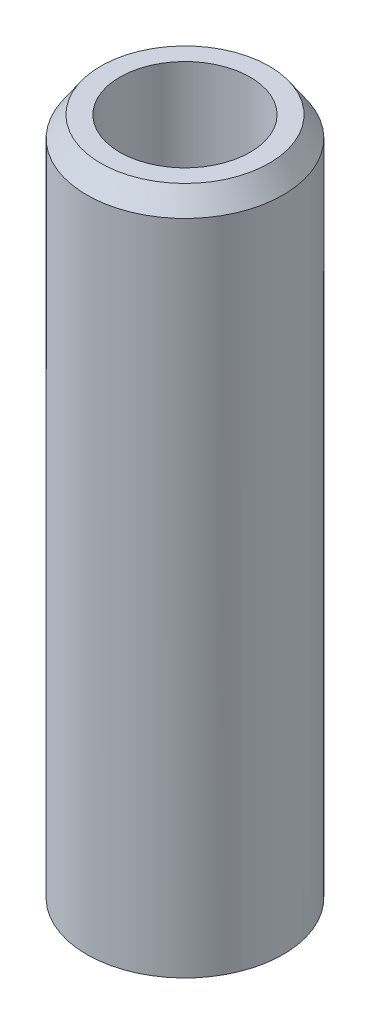
ISO-10303-21;
HEADER;
FILE_DESCRIPTION(('STEP AP214'),'2;1');
FILE_NAME('part.step','',(''),(''),'','','');
FILE_SCHEMA(('AUTOMOTIVE_DESIGN { 1 0 10303 214 1 1 1 1 }'));
ENDSEC;
DATA;
#1=APPLICATION_CONTEXT('core data for automotive mechanical design processes');
#2=APPLICATION_PROTOCOL_DEFINITION('international standard','automotive_design',2000,#1);
#3=PRODUCT_CONTEXT('',#1,'mechanical');
#4=PRODUCT('Part','Part','',(#3));
#5=PRODUCT_RELATED_PRODUCT_CATEGORY('part','',(#4));
#6=PRODUCT_DEFINITION_FORMATION('','',#4);
#7=PRODUCT_DEFINITION_CONTEXT('part definition',#1,'design');
#8=PRODUCT_DEFINITION('design','',#6,#7);
#9=PRODUCT_DEFINITION_SHAPE('','',#8);
#10=(LENGTH_UNIT() NAMED_UNIT(*) SI_UNIT(.MILLI.,.METRE.));
#11=(NAMED_UNIT(*) PLANE_ANGLE_UNIT() SI_UNIT($,.RADIAN.));
#12=(NAMED_UNIT(*) SI_UNIT($,.STERADIAN.) SOLID_ANGLE_UNIT());
#13=UNCERTAINTY_MEASURE_WITH_UNIT(LENGTH_MEASURE(1.E-05),#10,'distance_accuracy_value','');
#14=(GEOMETRIC_REPRESENTATION_CONTEXT(3) GLOBAL_UNCERTAINTY_ASSIGNED_CONTEXT((#13)) GLOBAL_UNIT_ASSIGNED_CONTEXT((#10,
#11,#12)) REPRESENTATION_CONTEXT('',''));
#15=CARTESIAN_POINT('',(0.,0.,0.));
#16=DIRECTION('',(0.,0.,1.));
#17=DIRECTION('',(1.,0.,0.));
#18=AXIS2_PLACEMENT_3D('',#15,#16,#17);
#19=CARTESIAN_POINT('',(0.,158.595899496815,0.));
#20=DIRECTION('',(0.,-1.,0.));
#21=DIRECTION('',(0.,0.,-1.));
#22=AXIS2_PLACEMENT_3D('',#19,#20,#21);
#23=CYLINDRICAL_SURFACE('',#22,22.5);
#24=CARTESIAN_POINT('',(0.,153.913828530528,0.));
#25=DIRECTION('',(0.,1.,0.));
#26=DIRECTION('',(0.,0.,1.));
#27=AXIS2_PLACEMENT_3D('',#24,#25,#26);
#28=CIRCLE('',#27,22.5);
#29=CARTESIAN_POINT('',(0.,153.913828530528,-22.5));
#30=VERTEX_POINT('',#29);
#31=EDGE_CURVE('E50',#30,#30,#28,.F.);
#32=ORIENTED_EDGE('',*,*,#31,.T.);
#33=EDGE_LOOP('',(#32));
#34=FACE_BOUND('',#33,.T.);
#35=CARTESIAN_POINT('',(0.,3.20565268522194,0.));
#36=DIRECTION('',(0.,1.,0.));
#37=DIRECTION('',(0.,0.,1.));
#38=AXIS2_PLACEMENT_3D('',#35,#36,#37);
#39=CIRCLE('',#38,22.5);
#40=CARTESIAN_POINT('',(0.,3.20565268522194,22.5));
#41=VERTEX_POINT('',#40);
#42=EDGE_CURVE('E51',#41,#41,#39,.T.);
#43=ORIENTED_EDGE('',*,*,#42,.T.);
#44=EDGE_LOOP('',(#43));
#45=FACE_BOUND('',#44,.T.);
#46=ADVANCED_FACE('F39',(#34,#45),#23,.T.);
#47=CARTESIAN_POINT('',(0.,158.595899496815,0.));
#48=DIRECTION('',(0.,1.,0.));
#49=DIRECTION('',(0.,0.,1.));
#50=AXIS2_PLACEMENT_3D('',#47,#48,#49);
#51=PLANE('',#50);
#52=CARTESIAN_POINT('',(0.,158.595899496815,0.));
#53=DIRECTION('',(0.,1.,0.));
#54=DIRECTION('',(0.,0.,1.));
#55=AXIS2_PLACEMENT_3D('',#52,#53,#54);
#56=CIRCLE('',#55,19.294347314778);
#57=CARTESIAN_POINT('',(0.,158.595899496815,-19.2943473147781));
#58=VERTEX_POINT('',#57);
#59=EDGE_CURVE('E54',#58,#58,#56,.T.);
#60=ORIENTED_EDGE('',*,*,#59,.T.);
#61=EDGE_LOOP('',(#60));
#62=FACE_BOUND('',#61,.T.);
#63=CARTESIAN_POINT('',(0.,158.595899496815,0.));
#64=DIRECTION('',(0.,1.,0.));
#65=DIRECTION('',(0.,0.,1.));
#66=AXIS2_PLACEMENT_3D('',#63,#64,#65);
#67=CIRCLE('',#66,14.9268336571655);
#68=CARTESIAN_POINT('',(0.,158.595899496815,14.9268336571655));
#69=VERTEX_POINT('',#68);
#70=EDGE_CURVE('E58',#69,#69,#67,.T.);
#71=ORIENTED_EDGE('',*,*,#70,.F.);
#72=EDGE_LOOP('',(#71));
#73=FACE_BOUND('',#72,.T.);
#74=ADVANCED_FACE('F69',(#62,#73),#51,.T.);
#75=CARTESIAN_POINT('',(0.,0.,0.));
#76=DIRECTION('',(0.,1.,0.));
#77=DIRECTION('',(0.,0.,1.));
#78=AXIS2_PLACEMENT_3D('',#75,#76,#77);
#79=PLANE('',#78);
#80=CARTESIAN_POINT('',(0.,0.,0.));
#81=DIRECTION('',(0.,1.,0.));
#82=DIRECTION('',(0.,0.,1.));
#83=AXIS2_PLACEMENT_3D('',#80,#81,#82);
#84=CIRCLE('',#83,17.8179290337135);
#85=CARTESIAN_POINT('',(0.,0.,17.8179290337135));
#86=VERTEX_POINT('',#85);
#87=EDGE_CURVE('E10',#86,#86,#84,.F.);
#88=ORIENTED_EDGE('',*,*,#87,.T.);
#89=EDGE_LOOP('',(#88));
#90=FACE_BOUND('',#89,.T.);
#91=CARTESIAN_POINT('',(0.,0.,0.));
#92=DIRECTION('',(0.,1.,0.));
#93=DIRECTION('',(0.,0.,1.));
#94=AXIS2_PLACEMENT_3D('',#91,#92,#93);
#95=CIRCLE('',#94,14.9268336571655);
#96=CARTESIAN_POINT('',(0.,0.,14.9268336571655));
#97=VERTEX_POINT('',#96);
#98=EDGE_CURVE('E63',#97,#97,#95,.T.);
#99=ORIENTED_EDGE('',*,*,#98,.T.);
#100=EDGE_LOOP('',(#99));
#101=FACE_BOUND('',#100,.T.);
#102=ADVANCED_FACE('F75',(#90,#101),#79,.F.);
#103=CARTESIAN_POINT('',(0.,158.595899496815,0.));
#104=DIRECTION('',(0.,-1.,0.));
#105=DIRECTION('',(0.,0.,-1.));
#106=AXIS2_PLACEMENT_3D('',#103,#104,#105);
#107=CYLINDRICAL_SURFACE('',#106,14.9268336571655);
#108=ORIENTED_EDGE('',*,*,#70,.T.);
#109=EDGE_LOOP('',(#108));
#110=FACE_BOUND('',#109,.T.);
#111=ORIENTED_EDGE('',*,*,#98,.F.);
#112=EDGE_LOOP('',(#111));
#113=FACE_BOUND('',#112,.T.);
#114=ADVANCED_FACE('F70',(#110,#113),#107,.F.);
#115=CARTESIAN_POINT('',(0.,158.595899496815,0.));
#116=DIRECTION('',(0.,-1.,0.));
#117=DIRECTION('',(0.,0.,-1.));
#118=AXIS2_PLACEMENT_3D('',#115,#116,#117);
#119=CONICAL_SURFACE('',#118,19.294347314778,0.600360077738182);
#120=CARTESIAN_POINT('',(0.,153.913828530528,-22.5));
#121=CARTESIAN_POINT('',(0.,153.962600103094,-22.4666077845289));
#122=CARTESIAN_POINT('',(0.,154.011371675659,-22.4332155690579));
#123=CARTESIAN_POINT('',(0.,154.10891482079,-22.3664311381158));
#124=CARTESIAN_POINT('',(0.,154.157686393356,-22.3330389226447));
#125=CARTESIAN_POINT('',(0.,154.255229538487,-22.2662544917026));
#126=CARTESIAN_POINT('',(0.,154.304001111052,-22.2328622762315));
#127=CARTESIAN_POINT('',(0.,154.401544256183,-22.1660778452894));
#128=CARTESIAN_POINT('',(0.,154.450315828749,-22.1326856298183));
#129=CARTESIAN_POINT('',(0.,154.54785897388,-22.0659011988762));
#130=CARTESIAN_POINT('',(0.,154.596630546445,-22.0325089834051));
#131=CARTESIAN_POINT('',(0.,154.694173691576,-21.965724552463));
#132=CARTESIAN_POINT('',(0.,154.742945264142,-21.932332336992));
#133=CARTESIAN_POINT('',(0.,154.840488409272,-21.8655479060498));
#134=CARTESIAN_POINT('',(0.,154.889259981838,-21.8321556905788));
#135=CARTESIAN_POINT('',(0.,154.986803126969,-21.7653712596366));
#136=CARTESIAN_POINT('',(0.,155.035574699534,-21.7319790441656));
#137=CARTESIAN_POINT('',(0.,155.133117844665,-21.6651946132235));
#138=CARTESIAN_POINT('',(0.,155.181889417231,-21.6318023977524));
#139=CARTESIAN_POINT('',(0.,155.279432562362,-21.5650179668103));
#140=CARTESIAN_POINT('',(0.,155.328204134927,-21.5316257513392));
#141=CARTESIAN_POINT('',(0.,155.425747280058,-21.4648413203971));
#142=CARTESIAN_POINT('',(0.,155.474518852624,-21.431449104926));
#143=CARTESIAN_POINT('',(0.,155.572061997755,-21.3646646739839));
#144=CARTESIAN_POINT('',(0.,155.62083357032,-21.3312724585128));
#145=CARTESIAN_POINT('',(0.,155.718376715451,-21.2644880275707));
#146=CARTESIAN_POINT('',(0.,155.767148288017,-21.2310958120997));
#147=CARTESIAN_POINT('',(0.,155.864691433148,-21.1643113811575));
#148=CARTESIAN_POINT('',(0.,155.913463005713,-21.1309191656865));
#149=CARTESIAN_POINT('',(0.,156.011006150844,-21.0641347347443));
#150=CARTESIAN_POINT('',(0.,156.05977772341,-21.0307425192733));
#151=CARTESIAN_POINT('',(0.,156.157320868541,-20.9639580883312));
#152=CARTESIAN_POINT('',(0.,156.206092441106,-20.9305658728601));
#153=CARTESIAN_POINT('',(0.,156.303635586237,-20.863781441918));
#154=CARTESIAN_POINT('',(0.,156.352407158803,-20.8303892264469));
#155=CARTESIAN_POINT('',(0.,156.449950303934,-20.7636047955048));
#156=CARTESIAN_POINT('',(0.,156.498721876499,-20.7302125800337));
#157=CARTESIAN_POINT('',(0.,156.59626502163,-20.6634281490916));
#158=CARTESIAN_POINT('',(0.,156.645036594195,-20.6300359336205));
#159=CARTESIAN_POINT('',(0.,156.742579739326,-20.5632515026784));
#160=CARTESIAN_POINT('',(0.,156.791351311892,-20.5298592872073));
#161=CARTESIAN_POINT('',(0.,156.888894457023,-20.4630748562652));
#162=CARTESIAN_POINT('',(0.,156.937666029588,-20.4296826407942));
#163=CARTESIAN_POINT('',(0.,157.035209174719,-20.362898209852));
#164=CARTESIAN_POINT('',(0.,157.083980747285,-20.329505994381));
#165=CARTESIAN_POINT('',(0.,157.181523892416,-20.2627215634388));
#166=CARTESIAN_POINT('',(0.,157.230295464981,-20.2293293479678));
#167=CARTESIAN_POINT('',(0.,157.327838610112,-20.1625449170257));
#168=CARTESIAN_POINT('',(0.,157.376610182678,-20.1291527015546));
#169=CARTESIAN_POINT('',(0.,157.474153327809,-20.0623682706125));
#170=CARTESIAN_POINT('',(0.,157.522924900374,-20.0289760551414));
#171=CARTESIAN_POINT('',(0.,157.620468045505,-19.9621916241993));
#172=CARTESIAN_POINT('',(0.,157.669239618071,-19.9287994087282));
#173=CARTESIAN_POINT('',(0.,157.766782763202,-19.8620149777861));
#174=CARTESIAN_POINT('',(0.,157.815554335767,-19.828622762315));
#175=CARTESIAN_POINT('',(0.,157.913097480898,-19.7618383313729));
#176=CARTESIAN_POINT('',(0.,157.961869053464,-19.7284461159019));
#177=CARTESIAN_POINT('',(0.,158.059412198595,-19.6616616849597));
#178=CARTESIAN_POINT('',(0.,158.10818377116,-19.6282694694887));
#179=CARTESIAN_POINT('',(0.,158.205726916291,-19.5614850385465));
#180=CARTESIAN_POINT('',(0.,158.254498488856,-19.5280928230755));
#181=CARTESIAN_POINT('',(0.,158.352041633987,-19.4613083921334));
#182=CARTESIAN_POINT('',(0.,158.400813206553,-19.4279161766623));
#183=CARTESIAN_POINT('',(0.,158.498356351684,-19.3611317457202));
#184=CARTESIAN_POINT('',(0.,158.547127924249,-19.3277395302491));
#185=CARTESIAN_POINT('',(0.,158.595899496815,-19.2943473147781));
#186=B_SPLINE_CURVE_WITH_KNOTS('',3,(#120,#121,#122,#123,#124,#125,#126,#127,#128,#129,#130,
#131,#132,#133,#134,#135,#136,#137,#138,#139,#140,#141,#142,#143,#144,#145,#146,#147,#148,#149,
#150,#151,#152,#153,#154,#155,#156,#157,#158,#159,#160,#161,#162,#163,#164,#165,#166,#167,#168,
#169,#170,#171,#172,#173,#174,#175,#176,#177,#178,#179,#180,#181,#182,#183,#184,#185),
.UNSPECIFIED.,.F.,.F.,(4,2,2,2,2,2,2,2,2,2,2,2,2,2,2,2,2,2,2,2,2,2,2,2,2,2,2,2,2,2,2,2,4),(0.,
0.177322748402965,0.354645496805953,0.531968245208916,0.709290993611904,0.886613742014892,
1.06393649041786,1.24125923882084,1.41858198722383,1.5959047356268,1.77322748402978,
1.95055023243275,2.12787298083574,2.30519572923872,2.48251847764169,2.65984122604467,
2.83716397444766,3.01448672285063,3.19180947125361,3.36913221965658,3.54645496805957,
3.72377771646255,3.90110046486552,4.07842321326851,4.25574596167149,4.43306871007446,
4.61039145847745,4.78771420688041,4.9650369552834,5.14235970368638,5.31968245208935,
5.49700520049234,5.67432794889532),.UNSPECIFIED.);
#187=EDGE_CURVE('BSEAM81',#30,#58,#186,.T.);
#188=ORIENTED_EDGE('',*,*,#31,.F.);
#189=ORIENTED_EDGE('',*,*,#59,.F.);
#190=ORIENTED_EDGE('',*,*,#187,.T.);
#191=ORIENTED_EDGE('',*,*,#187,.F.);
#192=EDGE_LOOP('',(#188,#190,#189,#191));
#193=FACE_BOUND('',#192,.T.);
#194=ADVANCED_FACE('F81',(#193),#119,.T.);
#195=CARTESIAN_POINT('',(0.,3.20565268522194,0.));
#196=DIRECTION('',(0.,1.,0.));
#197=DIRECTION('',(0.,0.,1.));
#198=AXIS2_PLACEMENT_3D('',#195,#196,#197);
#199=CONICAL_SURFACE('',#198,22.5,0.970436249056713);
#200=ORIENTED_EDGE('',*,*,#87,.F.);
#201=EDGE_LOOP('',(#200));
#202=FACE_BOUND('',#201,.T.);
#203=ORIENTED_EDGE('',*,*,#42,.F.);
#204=EDGE_LOOP('',(#203));
#205=FACE_BOUND('',#204,.T.);
#206=ADVANCED_FACE('F45',(#202,#205),#199,.T.);
#207=CLOSED_SHELL('',(#46,#74,#102,#114,#194,#206));
#208=MANIFOLD_SOLID_BREP('B2',#207);
#209=ADVANCED_BREP_SHAPE_REPRESENTATION('',(#18,#208),#14);
#210=SHAPE_DEFINITION_REPRESENTATION(#9,#209);
ENDSEC;
END-ISO-10303-21;
